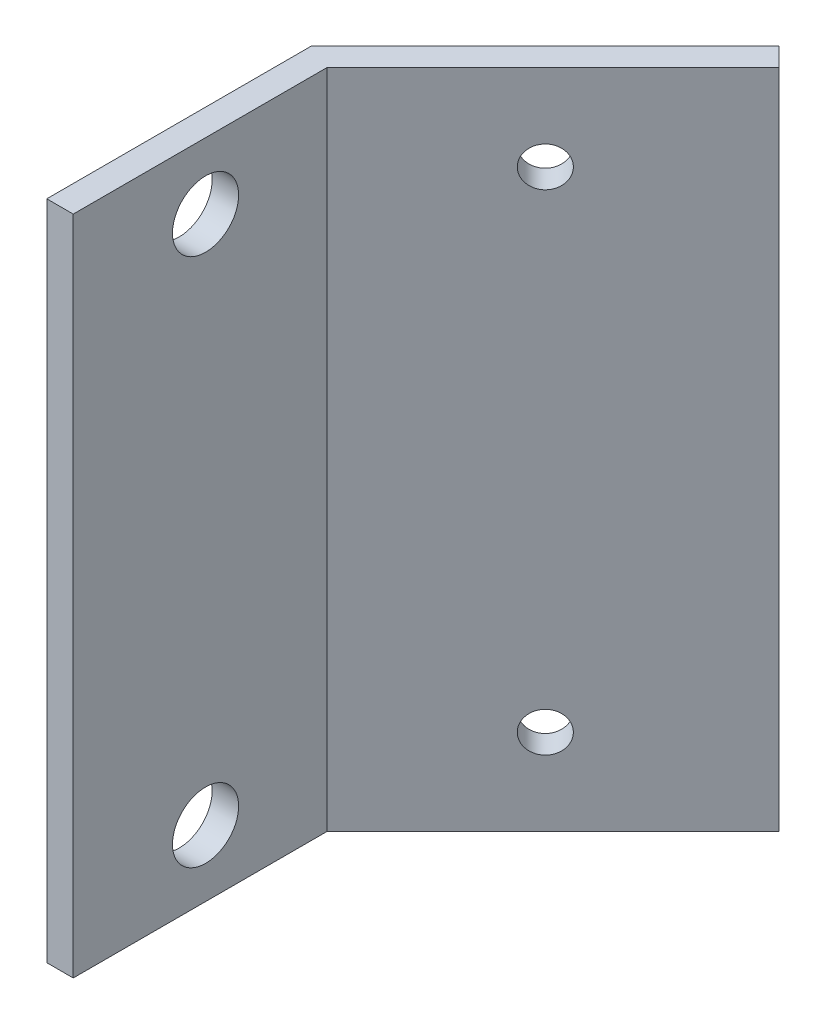
ISO-10303-21;
HEADER;
FILE_DESCRIPTION(('STEP AP214'),'2;1');
FILE_NAME('part.step','',(''),(''),'','','');
FILE_SCHEMA(('AUTOMOTIVE_DESIGN { 1 0 10303 214 1 1 1 1 }'));
ENDSEC;
DATA;
#1=APPLICATION_CONTEXT('core data for automotive mechanical design processes');
#2=APPLICATION_PROTOCOL_DEFINITION('international standard','automotive_design',2000,#1);
#3=PRODUCT_CONTEXT('',#1,'mechanical');
#4=PRODUCT('Part','Part','',(#3));
#5=PRODUCT_RELATED_PRODUCT_CATEGORY('part','',(#4));
#6=PRODUCT_DEFINITION_FORMATION('','',#4);
#7=PRODUCT_DEFINITION_CONTEXT('part definition',#1,'design');
#8=PRODUCT_DEFINITION('design','',#6,#7);
#9=PRODUCT_DEFINITION_SHAPE('','',#8);
#10=(LENGTH_UNIT() NAMED_UNIT(*) SI_UNIT(.MILLI.,.METRE.));
#11=(NAMED_UNIT(*) PLANE_ANGLE_UNIT() SI_UNIT($,.RADIAN.));
#12=(NAMED_UNIT(*) SI_UNIT($,.STERADIAN.) SOLID_ANGLE_UNIT());
#13=UNCERTAINTY_MEASURE_WITH_UNIT(LENGTH_MEASURE(1.E-05),#10,'distance_accuracy_value','');
#14=(GEOMETRIC_REPRESENTATION_CONTEXT(3) GLOBAL_UNCERTAINTY_ASSIGNED_CONTEXT((#13)) GLOBAL_UNIT_ASSIGNED_CONTEXT((#10,
#11,#12)) REPRESENTATION_CONTEXT('',''));
#15=CARTESIAN_POINT('',(0.,0.,0.));
#16=DIRECTION('',(0.,0.,1.));
#17=DIRECTION('',(1.,0.,0.));
#18=AXIS2_PLACEMENT_3D('',#15,#16,#17);
#19=CARTESIAN_POINT('',(2.,50.,0.));
#20=DIRECTION('',(0.,0.,-1.));
#21=DIRECTION('',(-1.,0.,0.));
#22=AXIS2_PLACEMENT_3D('',#19,#20,#21);
#23=PLANE('',#22);
#24=DIRECTION('',(1.,0.,0.));
#25=VECTOR('',#24,1.);
#26=CARTESIAN_POINT('',(2.,0.,0.));
#27=LINE('',#26,#25);
#28=CARTESIAN_POINT('',(0.,0.,0.));
#29=VERTEX_POINT('',#28);
#30=CARTESIAN_POINT('',(2.,0.,0.));
#31=VERTEX_POINT('',#30);
#32=EDGE_CURVE('E115',#29,#31,#27,.T.);
#33=ORIENTED_EDGE('',*,*,#32,.T.);
#34=DIRECTION('',(0.,-1.,0.));
#35=VECTOR('',#34,1.);
#36=CARTESIAN_POINT('',(2.,50.,0.));
#37=LINE('',#36,#35);
#38=CARTESIAN_POINT('',(2.,50.,0.));
#39=VERTEX_POINT('',#38);
#40=EDGE_CURVE('E11',#39,#31,#37,.T.);
#41=ORIENTED_EDGE('',*,*,#40,.F.);
#42=DIRECTION('',(1.,0.,0.));
#43=VECTOR('',#42,1.);
#44=CARTESIAN_POINT('',(2.,50.,0.));
#45=LINE('',#44,#43);
#46=CARTESIAN_POINT('',(0.,50.,0.));
#47=VERTEX_POINT('',#46);
#48=EDGE_CURVE('E126',#47,#39,#45,.T.);
#49=ORIENTED_EDGE('',*,*,#48,.F.);
#50=DIRECTION('',(0.,-1.,0.));
#51=VECTOR('',#50,1.);
#52=CARTESIAN_POINT('',(0.,50.,0.));
#53=LINE('',#52,#51);
#54=EDGE_CURVE('E111',#47,#29,#53,.T.);
#55=ORIENTED_EDGE('',*,*,#54,.T.);
#56=EDGE_LOOP('',(#33,#41,#49,#55));
#57=FACE_BOUND('',#56,.T.);
#58=ADVANCED_FACE('F31',(#57),#23,.F.);
#59=CARTESIAN_POINT('',(2.,50.,-19.1715728752538));
#60=DIRECTION('',(-1.,0.,0.));
#61=DIRECTION('',(0.,0.,1.));
#62=AXIS2_PLACEMENT_3D('',#59,#60,#61);
#63=PLANE('',#62);
#64=CARTESIAN_POINT('',(2.,45.,-10.));
#65=DIRECTION('',(-1.,0.,0.));
#66=DIRECTION('',(0.,0.,1.));
#67=AXIS2_PLACEMENT_3D('',#64,#65,#66);
#68=CIRCLE('',#67,2.5);
#69=CARTESIAN_POINT('',(2.,45.,-7.50000000000001));
#70=VERTEX_POINT('',#69);
#71=EDGE_CURVE('E260',#70,#70,#68,.F.);
#72=ORIENTED_EDGE('',*,*,#71,.F.);
#73=EDGE_LOOP('',(#72));
#74=FACE_BOUND('',#73,.T.);
#75=CARTESIAN_POINT('',(2.,5.00000000000001,-10.));
#76=DIRECTION('',(-1.,0.,0.));
#77=DIRECTION('',(0.,0.,1.));
#78=AXIS2_PLACEMENT_3D('',#75,#76,#77);
#79=CIRCLE('',#78,2.5);
#80=CARTESIAN_POINT('',(2.,5.00000000000001,-7.5));
#81=VERTEX_POINT('',#80);
#82=EDGE_CURVE('E119',#81,#81,#79,.F.);
#83=ORIENTED_EDGE('',*,*,#82,.F.);
#84=EDGE_LOOP('',(#83));
#85=FACE_BOUND('',#84,.T.);
#86=DIRECTION('',(0.,0.,-1.));
#87=VECTOR('',#86,1.);
#88=CARTESIAN_POINT('',(2.,0.,-19.1715728752538));
#89=LINE('',#88,#87);
#90=CARTESIAN_POINT('',(2.,0.,-19.1715728752538));
#91=VERTEX_POINT('',#90);
#92=EDGE_CURVE('E118',#31,#91,#89,.T.);
#93=ORIENTED_EDGE('',*,*,#92,.T.);
#94=DIRECTION('',(0.,-1.,0.));
#95=VECTOR('',#94,1.);
#96=CARTESIAN_POINT('',(2.,50.,-19.1715728752538));
#97=LINE('',#96,#95);
#98=CARTESIAN_POINT('',(2.,50.,-19.1715728752538));
#99=VERTEX_POINT('',#98);
#100=EDGE_CURVE('E39',#99,#91,#97,.T.);
#101=ORIENTED_EDGE('',*,*,#100,.F.);
#102=DIRECTION('',(0.,0.,-1.));
#103=VECTOR('',#102,1.);
#104=CARTESIAN_POINT('',(2.,50.,-19.1715728752538));
#105=LINE('',#104,#103);
#106=EDGE_CURVE('E84',#39,#99,#105,.T.);
#107=ORIENTED_EDGE('',*,*,#106,.F.);
#108=ORIENTED_EDGE('',*,*,#40,.T.);
#109=EDGE_LOOP('',(#93,#101,#107,#108));
#110=FACE_BOUND('',#109,.T.);
#111=ADVANCED_FACE('F154',(#74,#85,#110),#63,.F.);
#112=CARTESIAN_POINT('',(19.0918830920368,50.,-36.2634559672906));
#113=DIRECTION('',(-0.707106781186546,0.,-0.707106781186549));
#114=DIRECTION('',(-0.707106781186549,0.,0.707106781186546));
#115=AXIS2_PLACEMENT_3D('',#112,#113,#114);
#116=PLANE('',#115);
#117=CARTESIAN_POINT('',(10.253048327205,6.50000000000001,-27.4246212024587));
#118=DIRECTION('',(-0.707106781186546,0.,-0.707106781186549));
#119=DIRECTION('',(-0.707106781186549,0.,0.707106781186546));
#120=AXIS2_PLACEMENT_3D('',#117,#118,#119);
#121=CIRCLE('',#120,1.5);
#122=CARTESIAN_POINT('',(9.19238815542513,6.50000000000001,-26.3639610306789));
#123=VERTEX_POINT('',#122);
#124=EDGE_CURVE('E276',#123,#123,#121,.F.);
#125=ORIENTED_EDGE('',*,*,#124,.F.);
#126=EDGE_LOOP('',(#125));
#127=FACE_BOUND('',#126,.T.);
#128=CARTESIAN_POINT('',(10.253048327205,43.5,-27.4246212024587));
#129=DIRECTION('',(-0.707106781186546,0.,-0.707106781186549));
#130=DIRECTION('',(-0.707106781186549,0.,0.707106781186546));
#131=AXIS2_PLACEMENT_3D('',#128,#129,#130);
#132=CIRCLE('',#131,1.5);
#133=CARTESIAN_POINT('',(9.19238815542513,43.5,-26.3639610306789));
#134=VERTEX_POINT('',#133);
#135=EDGE_CURVE('E270',#134,#134,#132,.F.);
#136=ORIENTED_EDGE('',*,*,#135,.F.);
#137=EDGE_LOOP('',(#136));
#138=FACE_BOUND('',#137,.T.);
#139=DIRECTION('',(0.707106781186549,0.,-0.707106781186546));
#140=VECTOR('',#139,1.);
#141=CARTESIAN_POINT('',(19.0918830920368,0.,-36.2634559672906));
#142=LINE('',#141,#140);
#143=CARTESIAN_POINT('',(19.0918830920368,0.,-36.2634559672906));
#144=VERTEX_POINT('',#143);
#145=EDGE_CURVE('E121',#91,#144,#142,.T.);
#146=ORIENTED_EDGE('',*,*,#145,.T.);
#147=DIRECTION('',(0.,-1.,0.));
#148=VECTOR('',#147,1.);
#149=CARTESIAN_POINT('',(19.0918830920368,50.,-36.2634559672906));
#150=LINE('',#149,#148);
#151=CARTESIAN_POINT('',(19.0918830920368,50.,-36.2634559672906));
#152=VERTEX_POINT('',#151);
#153=EDGE_CURVE('E106',#152,#144,#150,.T.);
#154=ORIENTED_EDGE('',*,*,#153,.F.);
#155=DIRECTION('',(0.707106781186549,0.,-0.707106781186546));
#156=VECTOR('',#155,1.);
#157=CARTESIAN_POINT('',(19.0918830920368,50.,-36.2634559672906));
#158=LINE('',#157,#156);
#159=EDGE_CURVE('E97',#99,#152,#158,.T.);
#160=ORIENTED_EDGE('',*,*,#159,.F.);
#161=ORIENTED_EDGE('',*,*,#100,.T.);
#162=EDGE_LOOP('',(#146,#154,#160,#161));
#163=FACE_BOUND('',#162,.T.);
#164=ADVANCED_FACE('F132',(#127,#138,#163),#116,.F.);
#165=CARTESIAN_POINT('',(17.6776695296637,50.,-37.6776695296637));
#166=DIRECTION('',(-0.707106781186548,0.,0.707106781186547));
#167=DIRECTION('',(0.707106781186547,0.,0.707106781186548));
#168=AXIS2_PLACEMENT_3D('',#165,#166,#167);
#169=PLANE('',#168);
#170=DIRECTION('',(-0.707106781186547,0.,-0.707106781186548));
#171=VECTOR('',#170,1.);
#172=CARTESIAN_POINT('',(17.6776695296637,0.,-37.6776695296637));
#173=LINE('',#172,#171);
#174=CARTESIAN_POINT('',(17.6776695296637,0.,-37.6776695296637));
#175=VERTEX_POINT('',#174);
#176=EDGE_CURVE('E105',#144,#175,#173,.T.);
#177=ORIENTED_EDGE('',*,*,#176,.T.);
#178=DIRECTION('',(0.,-1.,0.));
#179=VECTOR('',#178,1.);
#180=CARTESIAN_POINT('',(17.6776695296637,50.,-37.6776695296637));
#181=LINE('',#180,#179);
#182=CARTESIAN_POINT('',(17.6776695296637,50.,-37.6776695296637));
#183=VERTEX_POINT('',#182);
#184=EDGE_CURVE('E102',#183,#175,#181,.T.);
#185=ORIENTED_EDGE('',*,*,#184,.F.);
#186=DIRECTION('',(-0.707106781186547,0.,-0.707106781186548));
#187=VECTOR('',#186,1.);
#188=CARTESIAN_POINT('',(17.6776695296637,50.,-37.6776695296637));
#189=LINE('',#188,#187);
#190=EDGE_CURVE('E91',#152,#183,#189,.T.);
#191=ORIENTED_EDGE('',*,*,#190,.F.);
#192=ORIENTED_EDGE('',*,*,#153,.T.);
#193=EDGE_LOOP('',(#177,#185,#191,#192));
#194=FACE_BOUND('',#193,.T.);
#195=ADVANCED_FACE('F103',(#194),#169,.F.);
#196=CARTESIAN_POINT('',(0.,50.,-20.));
#197=DIRECTION('',(0.707106781186546,0.,0.707106781186549));
#198=DIRECTION('',(0.707106781186549,0.,-0.707106781186546));
#199=AXIS2_PLACEMENT_3D('',#196,#197,#198);
#200=PLANE('',#199);
#201=CARTESIAN_POINT('',(8.83883476483185,6.50000000000001,-28.8388347648318));
#202=DIRECTION('',(-0.707106781186546,0.,-0.707106781186549));
#203=DIRECTION('',(0.707106781186549,0.,-0.707106781186546));
#204=AXIS2_PLACEMENT_3D('',#201,#202,#203);
#205=CIRCLE('',#204,1.5);
#206=CARTESIAN_POINT('',(9.89949493661168,6.50000000000001,-29.8994949366117));
#207=VERTEX_POINT('',#206);
#208=EDGE_CURVE('E279',#207,#207,#205,.T.);
#209=ORIENTED_EDGE('',*,*,#208,.F.);
#210=EDGE_LOOP('',(#209));
#211=FACE_BOUND('',#210,.T.);
#212=CARTESIAN_POINT('',(8.83883476483185,43.5,-28.8388347648318));
#213=DIRECTION('',(-0.707106781186546,0.,-0.707106781186549));
#214=DIRECTION('',(-0.707106781186549,0.,0.707106781186546));
#215=AXIS2_PLACEMENT_3D('',#212,#213,#214);
#216=CIRCLE('',#215,1.5);
#217=CARTESIAN_POINT('',(7.77817459305203,43.5,-27.778174593052));
#218=VERTEX_POINT('',#217);
#219=EDGE_CURVE('E273',#218,#218,#216,.T.);
#220=ORIENTED_EDGE('',*,*,#219,.F.);
#221=EDGE_LOOP('',(#220));
#222=FACE_BOUND('',#221,.T.);
#223=DIRECTION('',(-0.707106781186549,0.,0.707106781186546));
#224=VECTOR('',#223,1.);
#225=CARTESIAN_POINT('',(0.,0.,-20.));
#226=LINE('',#225,#224);
#227=CARTESIAN_POINT('',(0.,0.,-20.));
#228=VERTEX_POINT('',#227);
#229=EDGE_CURVE('E70',#175,#228,#226,.T.);
#230=ORIENTED_EDGE('',*,*,#229,.T.);
#231=DIRECTION('',(0.,-1.,0.));
#232=VECTOR('',#231,1.);
#233=CARTESIAN_POINT('',(0.,50.,-20.));
#234=LINE('',#233,#232);
#235=CARTESIAN_POINT('',(0.,50.,-20.));
#236=VERTEX_POINT('',#235);
#237=EDGE_CURVE('E107',#236,#228,#234,.T.);
#238=ORIENTED_EDGE('',*,*,#237,.F.);
#239=DIRECTION('',(-0.707106781186549,0.,0.707106781186546));
#240=VECTOR('',#239,1.);
#241=CARTESIAN_POINT('',(0.,50.,-20.));
#242=LINE('',#241,#240);
#243=EDGE_CURVE('E95',#183,#236,#242,.T.);
#244=ORIENTED_EDGE('',*,*,#243,.F.);
#245=ORIENTED_EDGE('',*,*,#184,.T.);
#246=EDGE_LOOP('',(#230,#238,#244,#245));
#247=FACE_BOUND('',#246,.T.);
#248=ADVANCED_FACE('F109',(#211,#222,#247),#200,.F.);
#249=CARTESIAN_POINT('',(0.,50.,0.));
#250=DIRECTION('',(1.,0.,0.));
#251=DIRECTION('',(0.,0.,-1.));
#252=AXIS2_PLACEMENT_3D('',#249,#250,#251);
#253=PLANE('',#252);
#254=CARTESIAN_POINT('',(0.,45.,-10.));
#255=DIRECTION('',(-1.,0.,0.));
#256=DIRECTION('',(0.,0.,-1.));
#257=AXIS2_PLACEMENT_3D('',#254,#255,#256);
#258=CIRCLE('',#257,2.5);
#259=CARTESIAN_POINT('',(0.,45.,-12.5));
#260=VERTEX_POINT('',#259);
#261=EDGE_CURVE('E267',#260,#260,#258,.T.);
#262=ORIENTED_EDGE('',*,*,#261,.F.);
#263=EDGE_LOOP('',(#262));
#264=FACE_BOUND('',#263,.T.);
#265=CARTESIAN_POINT('',(0.,5.00000000000001,-10.));
#266=DIRECTION('',(-1.,0.,0.));
#267=DIRECTION('',(0.,0.,1.));
#268=AXIS2_PLACEMENT_3D('',#265,#266,#267);
#269=CIRCLE('',#268,2.5);
#270=CARTESIAN_POINT('',(0.,5.00000000000001,-7.5));
#271=VERTEX_POINT('',#270);
#272=EDGE_CURVE('E256',#271,#271,#269,.T.);
#273=ORIENTED_EDGE('',*,*,#272,.F.);
#274=EDGE_LOOP('',(#273));
#275=FACE_BOUND('',#274,.T.);
#276=DIRECTION('',(0.,0.,1.));
#277=VECTOR('',#276,1.);
#278=CARTESIAN_POINT('',(0.,0.,0.));
#279=LINE('',#278,#277);
#280=EDGE_CURVE('E76',#228,#29,#279,.T.);
#281=ORIENTED_EDGE('',*,*,#280,.T.);
#282=ORIENTED_EDGE('',*,*,#54,.F.);
#283=DIRECTION('',(0.,0.,1.));
#284=VECTOR('',#283,1.);
#285=CARTESIAN_POINT('',(0.,50.,0.));
#286=LINE('',#285,#284);
#287=EDGE_CURVE('E47',#236,#47,#286,.T.);
#288=ORIENTED_EDGE('',*,*,#287,.F.);
#289=ORIENTED_EDGE('',*,*,#237,.T.);
#290=EDGE_LOOP('',(#281,#282,#288,#289));
#291=FACE_BOUND('',#290,.T.);
#292=ADVANCED_FACE('F139',(#264,#275,#291),#253,.F.);
#293=CARTESIAN_POINT('',(0.,50.,0.));
#294=DIRECTION('',(0.,-1.,0.));
#295=DIRECTION('',(0.,0.,-1.));
#296=AXIS2_PLACEMENT_3D('',#293,#294,#295);
#297=PLANE('',#296);
#298=ORIENTED_EDGE('',*,*,#48,.T.);
#299=ORIENTED_EDGE('',*,*,#106,.T.);
#300=ORIENTED_EDGE('',*,*,#159,.T.);
#301=ORIENTED_EDGE('',*,*,#190,.T.);
#302=ORIENTED_EDGE('',*,*,#243,.T.);
#303=ORIENTED_EDGE('',*,*,#287,.T.);
#304=EDGE_LOOP('',(#298,#299,#300,#301,#302,#303));
#305=FACE_BOUND('',#304,.T.);
#306=ADVANCED_FACE('F93',(#305),#297,.F.);
#307=CARTESIAN_POINT('',(0.,0.,0.));
#308=DIRECTION('',(0.,-1.,0.));
#309=DIRECTION('',(0.,0.,-1.));
#310=AXIS2_PLACEMENT_3D('',#307,#308,#309);
#311=PLANE('',#310);
#312=ORIENTED_EDGE('',*,*,#32,.F.);
#313=ORIENTED_EDGE('',*,*,#280,.F.);
#314=ORIENTED_EDGE('',*,*,#229,.F.);
#315=ORIENTED_EDGE('',*,*,#176,.F.);
#316=ORIENTED_EDGE('',*,*,#145,.F.);
#317=ORIENTED_EDGE('',*,*,#92,.F.);
#318=EDGE_LOOP('',(#312,#313,#314,#315,#316,#317));
#319=FACE_BOUND('',#318,.T.);
#320=ADVANCED_FACE('F135',(#319),#311,.T.);
#321=CARTESIAN_POINT('',(19.0928830920368,5.00000000000001,-10.));
#322=DIRECTION('',(-1.,0.,0.));
#323=DIRECTION('',(0.,0.,1.));
#324=AXIS2_PLACEMENT_3D('',#321,#322,#323);
#325=CYLINDRICAL_SURFACE('',#324,2.5);
#326=ORIENTED_EDGE('',*,*,#272,.T.);
#327=EDGE_LOOP('',(#326));
#328=FACE_BOUND('',#327,.T.);
#329=ORIENTED_EDGE('',*,*,#82,.T.);
#330=EDGE_LOOP('',(#329));
#331=FACE_BOUND('',#330,.T.);
#332=ADVANCED_FACE('F212',(#328,#331),#325,.F.);
#333=CARTESIAN_POINT('',(19.0928830920368,45.,-10.));
#334=DIRECTION('',(-1.,0.,0.));
#335=DIRECTION('',(0.,0.,1.));
#336=AXIS2_PLACEMENT_3D('',#333,#334,#335);
#337=CYLINDRICAL_SURFACE('',#336,2.5);
#338=ORIENTED_EDGE('',*,*,#261,.T.);
#339=EDGE_LOOP('',(#338));
#340=FACE_BOUND('',#339,.T.);
#341=ORIENTED_EDGE('',*,*,#71,.T.);
#342=EDGE_LOOP('',(#341));
#343=FACE_BOUND('',#342,.T.);
#344=ADVANCED_FACE('F192',(#340,#343),#337,.F.);
#345=CARTESIAN_POINT('',(28.3857763108502,43.5,-9.29189321881338));
#346=DIRECTION('',(-0.707106781186546,0.,-0.707106781186549));
#347=DIRECTION('',(-0.707106781186549,0.,0.707106781186546));
#348=AXIS2_PLACEMENT_3D('',#345,#346,#347);
#349=CYLINDRICAL_SURFACE('',#348,1.5);
#350=ORIENTED_EDGE('',*,*,#219,.T.);
#351=EDGE_LOOP('',(#350));
#352=FACE_BOUND('',#351,.T.);
#353=ORIENTED_EDGE('',*,*,#135,.T.);
#354=EDGE_LOOP('',(#353));
#355=FACE_BOUND('',#354,.T.);
#356=ADVANCED_FACE('F186',(#352,#355),#349,.F.);
#357=CARTESIAN_POINT('',(28.3857763108502,6.50000000000001,-9.29189321881338));
#358=DIRECTION('',(-0.707106781186546,0.,-0.707106781186549));
#359=DIRECTION('',(-0.707106781186549,0.,0.707106781186546));
#360=AXIS2_PLACEMENT_3D('',#357,#358,#359);
#361=CYLINDRICAL_SURFACE('',#360,1.5);
#362=ORIENTED_EDGE('',*,*,#208,.T.);
#363=EDGE_LOOP('',(#362));
#364=FACE_BOUND('',#363,.T.);
#365=ORIENTED_EDGE('',*,*,#124,.T.);
#366=EDGE_LOOP('',(#365));
#367=FACE_BOUND('',#366,.T.);
#368=ADVANCED_FACE('F191',(#364,#367),#361,.F.);
#369=CLOSED_SHELL('',(#58,#111,#164,#195,#248,#292,#306,#320,#332,#344,#356,#368));
#370=MANIFOLD_SOLID_BREP('B2',#369);
#371=ADVANCED_BREP_SHAPE_REPRESENTATION('',(#18,#370),#14);
#372=SHAPE_DEFINITION_REPRESENTATION(#9,#371);
ENDSEC;
END-ISO-10303-21;
